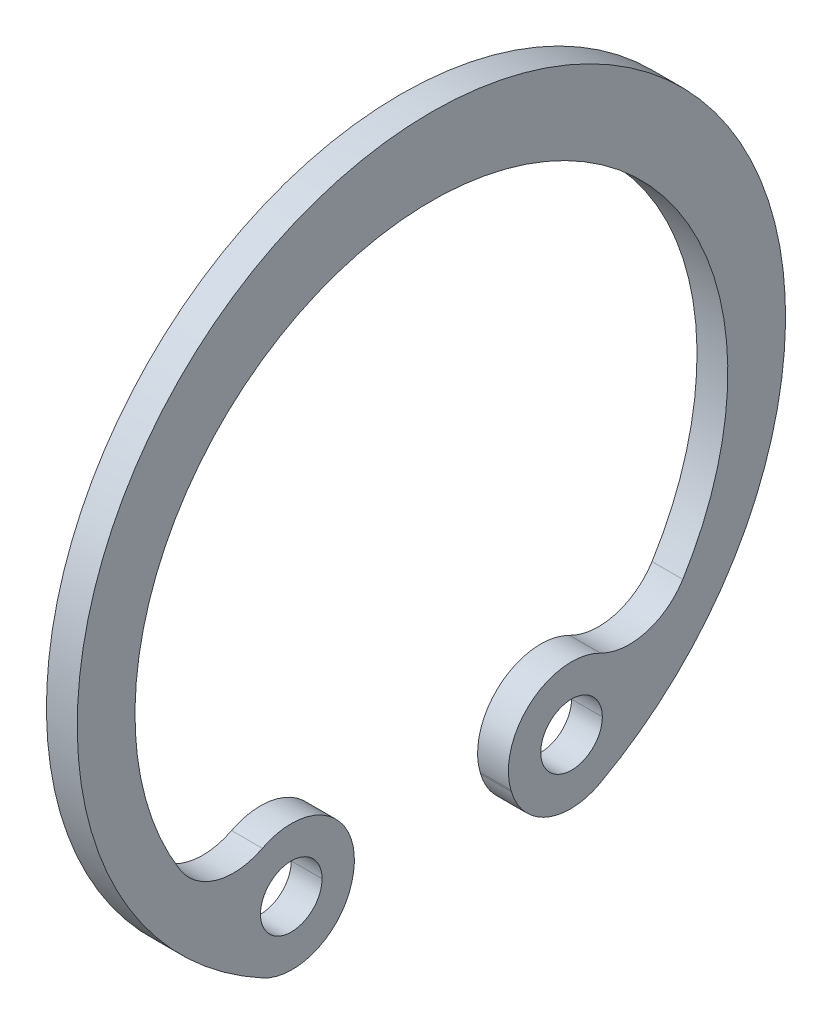
ISO-10303-21;
HEADER;
FILE_DESCRIPTION(('STEP AP214'),'2;1');
FILE_NAME('part.step','',(''),(''),'','','');
FILE_SCHEMA(('AUTOMOTIVE_DESIGN { 1 0 10303 214 1 1 1 1 }'));
ENDSEC;
DATA;
#1=APPLICATION_CONTEXT('core data for automotive mechanical design processes');
#2=APPLICATION_PROTOCOL_DEFINITION('international standard','automotive_design',2000,#1);
#3=PRODUCT_CONTEXT('',#1,'mechanical');
#4=PRODUCT('Part','Part','',(#3));
#5=PRODUCT_RELATED_PRODUCT_CATEGORY('part','',(#4));
#6=PRODUCT_DEFINITION_FORMATION('','',#4);
#7=PRODUCT_DEFINITION_CONTEXT('part definition',#1,'design');
#8=PRODUCT_DEFINITION('design','',#6,#7);
#9=PRODUCT_DEFINITION_SHAPE('','',#8);
#10=(LENGTH_UNIT() NAMED_UNIT(*) SI_UNIT(.MILLI.,.METRE.));
#11=(NAMED_UNIT(*) PLANE_ANGLE_UNIT() SI_UNIT($,.RADIAN.));
#12=(NAMED_UNIT(*) SI_UNIT($,.STERADIAN.) SOLID_ANGLE_UNIT());
#13=UNCERTAINTY_MEASURE_WITH_UNIT(LENGTH_MEASURE(1.E-05),#10,'distance_accuracy_value','');
#14=(GEOMETRIC_REPRESENTATION_CONTEXT(3) GLOBAL_UNCERTAINTY_ASSIGNED_CONTEXT((#13)) GLOBAL_UNIT_ASSIGNED_CONTEXT((#10,
#11,#12)) REPRESENTATION_CONTEXT('',''));
#15=CARTESIAN_POINT('',(0.,0.,0.));
#16=DIRECTION('',(0.,0.,1.));
#17=DIRECTION('',(1.,0.,0.));
#18=AXIS2_PLACEMENT_3D('',#15,#16,#17);
#19=CARTESIAN_POINT('',(0.5,-8.35614485396469,-4.51938526567201));
#20=DIRECTION('',(-1.,0.,0.));
#21=DIRECTION('',(0.,0.922739691980155,-0.385423741931357));
#22=AXIS2_PLACEMENT_3D('',#19,#20,#21);
#23=CYLINDRICAL_SURFACE('',#22,1.99999999999884);
#24=CARTESIAN_POINT('',(-0.5,-8.35614485396469,-4.51938526567201));
#25=DIRECTION('',(1.,0.,0.));
#26=DIRECTION('',(0.,0.,-1.));
#27=AXIS2_PLACEMENT_3D('',#24,#25,#26);
#28=CIRCLE('',#27,1.99999999999884);
#29=CARTESIAN_POINT('',(-0.5,-8.9159152274564,-2.5993183061739));
#30=VERTEX_POINT('',#29);
#31=CARTESIAN_POINT('',(-0.5,-10.115333244271,-5.4708347952882));
#32=VERTEX_POINT('',#31);
#33=EDGE_CURVE('E11',#30,#32,#28,.T.);
#34=ORIENTED_EDGE('',*,*,#33,.T.);
#35=DIRECTION('',(-1.,0.,0.));
#36=VECTOR('',#35,1.);
#37=CARTESIAN_POINT('',(0.5,-10.115333244271,-5.4708347952882));
#38=LINE('',#37,#36);
#39=CARTESIAN_POINT('',(0.5,-10.115333244271,-5.4708347952882));
#40=VERTEX_POINT('',#39);
#41=EDGE_CURVE('E25',#40,#32,#38,.T.);
#42=ORIENTED_EDGE('',*,*,#41,.F.);
#43=CARTESIAN_POINT('',(0.5,-8.35614485396469,-4.51938526567201));
#44=DIRECTION('',(1.,0.,0.));
#45=DIRECTION('',(0.,0.,-1.));
#46=AXIS2_PLACEMENT_3D('',#43,#44,#45);
#47=CIRCLE('',#46,1.99999999999884);
#48=CARTESIAN_POINT('',(0.5,-8.9159152274564,-2.5993183061739));
#49=VERTEX_POINT('',#48);
#50=EDGE_CURVE('E301',#49,#40,#47,.T.);
#51=ORIENTED_EDGE('',*,*,#50,.F.);
#52=DIRECTION('',(-1.,0.,0.));
#53=VECTOR('',#52,1.);
#54=CARTESIAN_POINT('',(0.5,-8.9159152274564,-2.5993183061739));
#55=LINE('',#54,#53);
#56=EDGE_CURVE('E297',#49,#30,#55,.T.);
#57=ORIENTED_EDGE('',*,*,#56,.T.);
#58=EDGE_LOOP('',(#34,#42,#51,#57));
#59=FACE_BOUND('',#58,.T.);
#60=ADVANCED_FACE('F17',(#59),#23,.T.);
#61=CARTESIAN_POINT('',(0.5,-8.8562763291698,-2.5819313665136));
#62=DIRECTION('',(0.,0.279885186746055,-0.9600334797496));
#63=DIRECTION('',(0.,0.9600334797496,0.279885186746055));
#64=AXIS2_PLACEMENT_3D('',#61,#62,#63);
#65=PLANE('',#64);
#66=DIRECTION('',(0.,-0.9600334797496,-0.279885186746055));
#67=VECTOR('',#66,1.);
#68=CARTESIAN_POINT('',(-0.5,-8.8562763291698,-2.5819313665136));
#69=LINE('',#68,#67);
#70=CARTESIAN_POINT('',(-0.5,-8.8562763291698,-2.5819313665136));
#71=VERTEX_POINT('',#70);
#72=EDGE_CURVE('E292',#71,#30,#69,.T.);
#73=ORIENTED_EDGE('',*,*,#72,.T.);
#74=ORIENTED_EDGE('',*,*,#56,.F.);
#75=DIRECTION('',(0.,-0.9600334797496,-0.279885186746055));
#76=VECTOR('',#75,1.);
#77=CARTESIAN_POINT('',(0.5,-8.8562763291698,-2.5819313665136));
#78=LINE('',#77,#76);
#79=CARTESIAN_POINT('',(0.5,-8.8562763291698,-2.5819313665136));
#80=VERTEX_POINT('',#79);
#81=EDGE_CURVE('E287',#80,#49,#78,.T.);
#82=ORIENTED_EDGE('',*,*,#81,.F.);
#83=DIRECTION('',(-1.,0.,0.));
#84=VECTOR('',#83,1.);
#85=CARTESIAN_POINT('',(0.5,-8.8562763291698,-2.5819313665136));
#86=LINE('',#85,#84);
#87=EDGE_CURVE('E283',#80,#71,#86,.T.);
#88=ORIENTED_EDGE('',*,*,#87,.T.);
#89=EDGE_LOOP('',(#73,#74,#82,#88));
#90=FACE_BOUND('',#89,.T.);
#91=ADVANCED_FACE('F318',(#90),#65,.F.);
#92=CARTESIAN_POINT('',(0.5,-8.28251169633942,-4.55));
#93=DIRECTION('',(-1.,0.,0.));
#94=DIRECTION('',(0.,-0.771452706473191,-0.636286666271727));
#95=AXIS2_PLACEMENT_3D('',#92,#93,#94);
#96=CYLINDRICAL_SURFACE('',#95,2.04999999999997);
#97=CARTESIAN_POINT('',(-0.5,-8.28251169633942,-4.55));
#98=DIRECTION('',(1.,0.,0.));
#99=DIRECTION('',(0.,0.,-1.));
#100=AXIS2_PLACEMENT_3D('',#97,#98,#99);
#101=CIRCLE('',#100,2.04999999999997);
#102=CARTESIAN_POINT('',(-0.5,-6.4595744916504,-5.4877632685067));
#103=VERTEX_POINT('',#102);
#104=EDGE_CURVE('E278',#103,#71,#101,.T.);
#105=ORIENTED_EDGE('',*,*,#104,.T.);
#106=ORIENTED_EDGE('',*,*,#87,.F.);
#107=CARTESIAN_POINT('',(0.5,-8.28251169633942,-4.55));
#108=DIRECTION('',(1.,0.,0.));
#109=DIRECTION('',(0.,0.,-1.));
#110=AXIS2_PLACEMENT_3D('',#107,#108,#109);
#111=CIRCLE('',#110,2.04999999999997);
#112=CARTESIAN_POINT('',(0.5,-6.4595744916504,-5.4877632685067));
#113=VERTEX_POINT('',#112);
#114=EDGE_CURVE('E273',#113,#80,#111,.T.);
#115=ORIENTED_EDGE('',*,*,#114,.F.);
#116=DIRECTION('',(-1.,0.,0.));
#117=VECTOR('',#116,1.);
#118=CARTESIAN_POINT('',(0.5,-6.4595744916504,-5.4877632685067));
#119=LINE('',#118,#117);
#120=EDGE_CURVE('E269',#113,#103,#119,.T.);
#121=ORIENTED_EDGE('',*,*,#120,.T.);
#122=EDGE_LOOP('',(#105,#106,#115,#121));
#123=FACE_BOUND('',#122,.T.);
#124=ADVANCED_FACE('F350',(#123),#96,.T.);
#125=CARTESIAN_POINT('',(0.5,-4.63663728696139,-6.42552653701331));
#126=DIRECTION('',(-1.,0.,0.));
#127=DIRECTION('',(0.,0.964095608375025,0.265555376356778));
#128=AXIS2_PLACEMENT_3D('',#125,#126,#127);
#129=CYLINDRICAL_SURFACE('',#128,2.0499999999999);
#130=CARTESIAN_POINT('',(-0.5,-4.63663728696139,-6.42552653701331));
#131=DIRECTION('',(1.,0.,0.));
#132=DIRECTION('',(0.,0.,-1.));
#133=AXIS2_PLACEMENT_3D('',#130,#131,#132);
#134=CIRCLE('',#133,2.0499999999999);
#135=CARTESIAN_POINT('',(-0.5,-5.7222949025745,-8.1644479100664));
#136=VERTEX_POINT('',#135);
#137=EDGE_CURVE('E264',#103,#136,#134,.T.);
#138=ORIENTED_EDGE('',*,*,#137,.F.);
#139=ORIENTED_EDGE('',*,*,#120,.F.);
#140=CARTESIAN_POINT('',(0.5,-4.63663728696139,-6.42552653701331));
#141=DIRECTION('',(1.,0.,0.));
#142=DIRECTION('',(0.,0.,-1.));
#143=AXIS2_PLACEMENT_3D('',#140,#141,#142);
#144=CIRCLE('',#143,2.0499999999999);
#145=CARTESIAN_POINT('',(0.5,-5.7222949025745,-8.1644479100664));
#146=VERTEX_POINT('',#145);
#147=EDGE_CURVE('E260',#113,#146,#144,.T.);
#148=ORIENTED_EDGE('',*,*,#147,.T.);
#149=DIRECTION('',(-1.,0.,0.));
#150=VECTOR('',#149,1.);
#151=CARTESIAN_POINT('',(0.5,-5.7222949025745,-8.1644479100664));
#152=LINE('',#151,#150);
#153=EDGE_CURVE('E256',#146,#136,#152,.T.);
#154=ORIENTED_EDGE('',*,*,#153,.T.);
#155=EDGE_LOOP('',(#138,#139,#148,#154));
#156=FACE_BOUND('',#155,.T.);
#157=ADVANCED_FACE('F347',(#156),#129,.F.);
#158=CARTESIAN_POINT('',(0.5,-0.624999999999986,0.));
#159=DIRECTION('',(-1.,0.,0.));
#160=DIRECTION('',(0.,-1.,0.));
#161=AXIS2_PLACEMENT_3D('',#158,#159,#160);
#162=CYLINDRICAL_SURFACE('',#161,9.625);
#163=CARTESIAN_POINT('',(-0.5,-0.624999999999986,0.));
#164=DIRECTION('',(1.,0.,0.));
#165=DIRECTION('',(0.,0.,-1.));
#166=AXIS2_PLACEMENT_3D('',#163,#164,#165);
#167=CIRCLE('',#166,9.625);
#168=CARTESIAN_POINT('',(-0.5,-5.7222949025745,8.1644479100664));
#169=VERTEX_POINT('',#168);
#170=EDGE_CURVE('E251',#136,#169,#167,.T.);
#171=ORIENTED_EDGE('',*,*,#170,.F.);
#172=ORIENTED_EDGE('',*,*,#153,.F.);
#173=CARTESIAN_POINT('',(0.5,-0.624999999999986,0.));
#174=DIRECTION('',(1.,0.,0.));
#175=DIRECTION('',(0.,0.,-1.));
#176=AXIS2_PLACEMENT_3D('',#173,#174,#175);
#177=CIRCLE('',#176,9.625);
#178=CARTESIAN_POINT('',(0.5,-5.7222949025745,8.1644479100664));
#179=VERTEX_POINT('',#178);
#180=EDGE_CURVE('E247',#146,#179,#177,.T.);
#181=ORIENTED_EDGE('',*,*,#180,.T.);
#182=DIRECTION('',(-1.,0.,0.));
#183=VECTOR('',#182,1.);
#184=CARTESIAN_POINT('',(0.5,-5.7222949025745,8.1644479100664));
#185=LINE('',#184,#183);
#186=EDGE_CURVE('E243',#179,#169,#185,.T.);
#187=ORIENTED_EDGE('',*,*,#186,.T.);
#188=EDGE_LOOP('',(#171,#172,#181,#187));
#189=FACE_BOUND('',#188,.T.);
#190=ADVANCED_FACE('F344',(#189),#162,.F.);
#191=CARTESIAN_POINT('',(0.5,-4.63663728696139,6.42552653701331));
#192=DIRECTION('',(-1.,0.,0.));
#193=DIRECTION('',(0.,0.964095608375026,-0.265555376356777));
#194=AXIS2_PLACEMENT_3D('',#191,#192,#193);
#195=CYLINDRICAL_SURFACE('',#194,2.0499999999999);
#196=CARTESIAN_POINT('',(-0.5,-4.63663728696139,6.42552653701331));
#197=DIRECTION('',(1.,0.,0.));
#198=DIRECTION('',(0.,0.,-1.));
#199=AXIS2_PLACEMENT_3D('',#196,#197,#198);
#200=CIRCLE('',#199,2.0499999999999);
#201=CARTESIAN_POINT('',(-0.5,-6.4595744916504,5.4877632685067));
#202=VERTEX_POINT('',#201);
#203=EDGE_CURVE('E238',#169,#202,#200,.T.);
#204=ORIENTED_EDGE('',*,*,#203,.F.);
#205=ORIENTED_EDGE('',*,*,#186,.F.);
#206=CARTESIAN_POINT('',(0.5,-4.63663728696139,6.42552653701331));
#207=DIRECTION('',(1.,0.,0.));
#208=DIRECTION('',(0.,0.,-1.));
#209=AXIS2_PLACEMENT_3D('',#206,#207,#208);
#210=CIRCLE('',#209,2.0499999999999);
#211=CARTESIAN_POINT('',(0.5,-6.4595744916504,5.4877632685067));
#212=VERTEX_POINT('',#211);
#213=EDGE_CURVE('E234',#179,#212,#210,.T.);
#214=ORIENTED_EDGE('',*,*,#213,.T.);
#215=DIRECTION('',(-1.,0.,0.));
#216=VECTOR('',#215,1.);
#217=CARTESIAN_POINT('',(0.5,-6.4595744916504,5.4877632685067));
#218=LINE('',#217,#216);
#219=EDGE_CURVE('E230',#212,#202,#218,.T.);
#220=ORIENTED_EDGE('',*,*,#219,.T.);
#221=EDGE_LOOP('',(#204,#205,#214,#220));
#222=FACE_BOUND('',#221,.T.);
#223=ADVANCED_FACE('F337',(#222),#195,.F.);
#224=CARTESIAN_POINT('',(0.5,-8.28251169633942,4.55));
#225=DIRECTION('',(-1.,0.,0.));
#226=DIRECTION('',(0.,-0.771452706473191,0.636286666271728));
#227=AXIS2_PLACEMENT_3D('',#224,#225,#226);
#228=CYLINDRICAL_SURFACE('',#227,2.04999999999997);
#229=CARTESIAN_POINT('',(-0.5,-8.28251169633942,4.55));
#230=DIRECTION('',(1.,0.,0.));
#231=DIRECTION('',(0.,0.,-1.));
#232=AXIS2_PLACEMENT_3D('',#229,#230,#231);
#233=CIRCLE('',#232,2.04999999999997);
#234=CARTESIAN_POINT('',(-0.5,-8.8562763291698,2.5819313665136));
#235=VERTEX_POINT('',#234);
#236=EDGE_CURVE('E225',#235,#202,#233,.T.);
#237=ORIENTED_EDGE('',*,*,#236,.T.);
#238=ORIENTED_EDGE('',*,*,#219,.F.);
#239=CARTESIAN_POINT('',(0.5,-8.28251169633942,4.55));
#240=DIRECTION('',(1.,0.,0.));
#241=DIRECTION('',(0.,0.,-1.));
#242=AXIS2_PLACEMENT_3D('',#239,#240,#241);
#243=CIRCLE('',#242,2.04999999999997);
#244=CARTESIAN_POINT('',(0.5,-8.8562763291698,2.5819313665136));
#245=VERTEX_POINT('',#244);
#246=EDGE_CURVE('E220',#245,#212,#243,.T.);
#247=ORIENTED_EDGE('',*,*,#246,.F.);
#248=DIRECTION('',(-1.,0.,0.));
#249=VECTOR('',#248,1.);
#250=CARTESIAN_POINT('',(0.5,-8.8562763291698,2.5819313665136));
#251=LINE('',#250,#249);
#252=EDGE_CURVE('E216',#245,#235,#251,.T.);
#253=ORIENTED_EDGE('',*,*,#252,.T.);
#254=EDGE_LOOP('',(#237,#238,#247,#253));
#255=FACE_BOUND('',#254,.T.);
#256=ADVANCED_FACE('F334',(#255),#228,.T.);
#257=CARTESIAN_POINT('',(0.5,-8.9159152274564,2.5993183061739));
#258=DIRECTION('',(0.,0.279885186746055,0.9600334797496));
#259=DIRECTION('',(0.,-0.9600334797496,0.279885186746055));
#260=AXIS2_PLACEMENT_3D('',#257,#258,#259);
#261=PLANE('',#260);
#262=DIRECTION('',(0.,0.9600334797496,-0.279885186746055));
#263=VECTOR('',#262,1.);
#264=CARTESIAN_POINT('',(-0.5,-8.9159152274564,2.5993183061739));
#265=LINE('',#264,#263);
#266=CARTESIAN_POINT('',(-0.5,-8.9159152274564,2.5993183061739));
#267=VERTEX_POINT('',#266);
#268=EDGE_CURVE('E211',#267,#235,#265,.T.);
#269=ORIENTED_EDGE('',*,*,#268,.T.);
#270=ORIENTED_EDGE('',*,*,#252,.F.);
#271=DIRECTION('',(0.,0.9600334797496,-0.279885186746055));
#272=VECTOR('',#271,1.);
#273=CARTESIAN_POINT('',(0.5,-8.9159152274564,2.5993183061739));
#274=LINE('',#273,#272);
#275=CARTESIAN_POINT('',(0.5,-8.9159152274564,2.5993183061739));
#276=VERTEX_POINT('',#275);
#277=EDGE_CURVE('E206',#276,#245,#274,.T.);
#278=ORIENTED_EDGE('',*,*,#277,.F.);
#279=DIRECTION('',(-1.,0.,0.));
#280=VECTOR('',#279,1.);
#281=CARTESIAN_POINT('',(0.5,-8.9159152274564,2.5993183061739));
#282=LINE('',#281,#280);
#283=EDGE_CURVE('E202',#276,#267,#282,.T.);
#284=ORIENTED_EDGE('',*,*,#283,.T.);
#285=EDGE_LOOP('',(#269,#270,#278,#284));
#286=FACE_BOUND('',#285,.T.);
#287=ADVANCED_FACE('F332',(#286),#261,.F.);
#288=CARTESIAN_POINT('',(0.5,-8.3561448539647,4.51938526567201));
#289=DIRECTION('',(-1.,0.,0.));
#290=DIRECTION('',(0.,0.922739691980155,0.385423741931357));
#291=AXIS2_PLACEMENT_3D('',#288,#289,#290);
#292=CYLINDRICAL_SURFACE('',#291,1.99999999999884);
#293=CARTESIAN_POINT('',(-0.5,-8.3561448539647,4.51938526567201));
#294=DIRECTION('',(1.,0.,0.));
#295=DIRECTION('',(0.,0.,-1.));
#296=AXIS2_PLACEMENT_3D('',#293,#294,#295);
#297=CIRCLE('',#296,1.99999999999884);
#298=CARTESIAN_POINT('',(-0.5,-10.115333244271,5.47083479528821));
#299=VERTEX_POINT('',#298);
#300=EDGE_CURVE('E197',#299,#267,#297,.T.);
#301=ORIENTED_EDGE('',*,*,#300,.T.);
#302=ORIENTED_EDGE('',*,*,#283,.F.);
#303=CARTESIAN_POINT('',(0.5,-8.3561448539647,4.51938526567201));
#304=DIRECTION('',(1.,0.,0.));
#305=DIRECTION('',(0.,0.,-1.));
#306=AXIS2_PLACEMENT_3D('',#303,#304,#305);
#307=CIRCLE('',#306,1.99999999999884);
#308=CARTESIAN_POINT('',(0.5,-10.115333244271,5.47083479528821));
#309=VERTEX_POINT('',#308);
#310=EDGE_CURVE('E192',#309,#276,#307,.T.);
#311=ORIENTED_EDGE('',*,*,#310,.F.);
#312=DIRECTION('',(-1.,0.,0.));
#313=VECTOR('',#312,1.);
#314=CARTESIAN_POINT('',(0.5,-10.115333244271,5.47083479528821));
#315=LINE('',#314,#313);
#316=EDGE_CURVE('E188',#309,#299,#315,.T.);
#317=ORIENTED_EDGE('',*,*,#316,.T.);
#318=EDGE_LOOP('',(#301,#302,#311,#317));
#319=FACE_BOUND('',#318,.T.);
#320=ADVANCED_FACE('F327',(#319),#292,.T.);
#321=CARTESIAN_POINT('',(0.5,2.27682456221956E-13,0.));
#322=DIRECTION('',(-1.,0.,0.));
#323=DIRECTION('',(0.,-1.,0.));
#324=AXIS2_PLACEMENT_3D('',#321,#322,#323);
#325=CYLINDRICAL_SURFACE('',#324,11.4999999999998);
#326=CARTESIAN_POINT('',(-0.5,2.27682456221956E-13,0.));
#327=DIRECTION('',(1.,0.,0.));
#328=DIRECTION('',(0.,0.,-1.));
#329=AXIS2_PLACEMENT_3D('',#326,#327,#328);
#330=CIRCLE('',#329,11.4999999999998);
#331=EDGE_CURVE('E183',#32,#299,#330,.T.);
#332=ORIENTED_EDGE('',*,*,#331,.T.);
#333=ORIENTED_EDGE('',*,*,#316,.F.);
#334=CARTESIAN_POINT('',(0.5,2.27682456221956E-13,0.));
#335=DIRECTION('',(1.,0.,0.));
#336=DIRECTION('',(0.,0.,-1.));
#337=AXIS2_PLACEMENT_3D('',#334,#335,#336);
#338=CIRCLE('',#337,11.4999999999998);
#339=EDGE_CURVE('E178',#40,#309,#338,.T.);
#340=ORIENTED_EDGE('',*,*,#339,.F.);
#341=ORIENTED_EDGE('',*,*,#41,.T.);
#342=EDGE_LOOP('',(#332,#333,#340,#341));
#343=FACE_BOUND('',#342,.T.);
#344=ADVANCED_FACE('F311',(#343),#325,.T.);
#345=CARTESIAN_POINT('',(0.5,-8.35614485396469,-4.51938526567201));
#346=DIRECTION('',(1.,0.,0.));
#347=DIRECTION('',(0.,0.,-1.));
#348=AXIS2_PLACEMENT_3D('',#345,#346,#347);
#349=PLANE('',#348);
#350=CARTESIAN_POINT('',(0.5,-8.2825116963395,4.55));
#351=DIRECTION('',(1.,0.,0.));
#352=DIRECTION('',(0.,0.,-1.));
#353=AXIS2_PLACEMENT_3D('',#350,#351,#352);
#354=CIRCLE('',#353,1.);
#355=CARTESIAN_POINT('',(0.5,-8.2825116963395,5.55));
#356=VERTEX_POINT('',#355);
#357=CARTESIAN_POINT('',(0.5,-8.2825116963395,3.55));
#358=VERTEX_POINT('',#357);
#359=EDGE_CURVE('E134',#356,#358,#354,.T.);
#360=ORIENTED_EDGE('',*,*,#359,.F.);
#361=CARTESIAN_POINT('',(0.5,-8.2825116963395,4.55));
#362=DIRECTION('',(1.,0.,0.));
#363=DIRECTION('',(0.,0.,-1.));
#364=AXIS2_PLACEMENT_3D('',#361,#362,#363);
#365=CIRCLE('',#364,1.);
#366=EDGE_CURVE('E171',#358,#356,#365,.T.);
#367=ORIENTED_EDGE('',*,*,#366,.F.);
#368=EDGE_LOOP('',(#360,#367));
#369=FACE_BOUND('',#368,.T.);
#370=CARTESIAN_POINT('',(0.5,-8.2825116963395,-4.55));
#371=DIRECTION('',(1.,0.,0.));
#372=DIRECTION('',(0.,0.,-1.));
#373=AXIS2_PLACEMENT_3D('',#370,#371,#372);
#374=CIRCLE('',#373,1.);
#375=CARTESIAN_POINT('',(0.5,-8.2825116963395,-3.55));
#376=VERTEX_POINT('',#375);
#377=CARTESIAN_POINT('',(0.5,-8.2825116963395,-5.55));
#378=VERTEX_POINT('',#377);
#379=EDGE_CURVE('E166',#376,#378,#374,.T.);
#380=ORIENTED_EDGE('',*,*,#379,.F.);
#381=CARTESIAN_POINT('',(0.5,-8.2825116963395,-4.55));
#382=DIRECTION('',(1.,0.,0.));
#383=DIRECTION('',(0.,0.,-1.));
#384=AXIS2_PLACEMENT_3D('',#381,#382,#383);
#385=CIRCLE('',#384,1.);
#386=EDGE_CURVE('E161',#378,#376,#385,.T.);
#387=ORIENTED_EDGE('',*,*,#386,.F.);
#388=EDGE_LOOP('',(#380,#387));
#389=FACE_BOUND('',#388,.T.);
#390=ORIENTED_EDGE('',*,*,#50,.T.);
#391=ORIENTED_EDGE('',*,*,#339,.T.);
#392=ORIENTED_EDGE('',*,*,#310,.T.);
#393=ORIENTED_EDGE('',*,*,#277,.T.);
#394=ORIENTED_EDGE('',*,*,#246,.T.);
#395=ORIENTED_EDGE('',*,*,#213,.F.);
#396=ORIENTED_EDGE('',*,*,#180,.F.);
#397=ORIENTED_EDGE('',*,*,#147,.F.);
#398=ORIENTED_EDGE('',*,*,#114,.T.);
#399=ORIENTED_EDGE('',*,*,#81,.T.);
#400=EDGE_LOOP('',(#390,#391,#392,#393,#394,#395,#396,#397,#398,#399));
#401=FACE_BOUND('',#400,.T.);
#402=ADVANCED_FACE('F315',(#369,#389,#401),#349,.T.);
#403=CARTESIAN_POINT('',(0.5,-8.2825116963395,-4.55));
#404=DIRECTION('',(-1.,0.,0.));
#405=DIRECTION('',(0.,-1.,0.));
#406=AXIS2_PLACEMENT_3D('',#403,#404,#405);
#407=CYLINDRICAL_SURFACE('',#406,1.);
#408=DIRECTION('',(-1.,0.,0.));
#409=VECTOR('',#408,1.);
#410=CARTESIAN_POINT('',(0.5,-8.2825116963395,-5.55));
#411=LINE('',#410,#409);
#412=CARTESIAN_POINT('',(-0.5,-8.2825116963395,-5.55));
#413=VERTEX_POINT('',#412);
#414=EDGE_CURVE('E156',#378,#413,#411,.T.);
#415=ORIENTED_EDGE('',*,*,#414,.F.);
#416=ORIENTED_EDGE('',*,*,#386,.T.);
#417=DIRECTION('',(-1.,0.,0.));
#418=VECTOR('',#417,1.);
#419=CARTESIAN_POINT('',(0.5,-8.2825116963395,-3.55));
#420=LINE('',#419,#418);
#421=CARTESIAN_POINT('',(-0.5,-8.2825116963395,-3.55));
#422=VERTEX_POINT('',#421);
#423=EDGE_CURVE('E152',#376,#422,#420,.T.);
#424=ORIENTED_EDGE('',*,*,#423,.T.);
#425=CARTESIAN_POINT('',(-0.5,-8.2825116963395,-4.55));
#426=DIRECTION('',(1.,0.,0.));
#427=DIRECTION('',(0.,0.,-1.));
#428=AXIS2_PLACEMENT_3D('',#425,#426,#427);
#429=CIRCLE('',#428,1.);
#430=EDGE_CURVE('E131',#413,#422,#429,.T.);
#431=ORIENTED_EDGE('',*,*,#430,.F.);
#432=EDGE_LOOP('',(#415,#416,#424,#431));
#433=FACE_BOUND('',#432,.T.);
#434=ADVANCED_FACE('F447',(#433),#407,.F.);
#435=CARTESIAN_POINT('',(-0.5,-8.35614485396469,-4.51938526567201));
#436=DIRECTION('',(1.,0.,0.));
#437=DIRECTION('',(0.,0.,-1.));
#438=AXIS2_PLACEMENT_3D('',#435,#436,#437);
#439=PLANE('',#438);
#440=CARTESIAN_POINT('',(-0.5,-8.2825116963395,4.55));
#441=DIRECTION('',(1.,0.,0.));
#442=DIRECTION('',(0.,0.,-1.));
#443=AXIS2_PLACEMENT_3D('',#440,#441,#442);
#444=CIRCLE('',#443,1.);
#445=CARTESIAN_POINT('',(-0.5,-8.2825116963395,3.55));
#446=VERTEX_POINT('',#445);
#447=CARTESIAN_POINT('',(-0.5,-8.2825116963395,5.55));
#448=VERTEX_POINT('',#447);
#449=EDGE_CURVE('E117',#446,#448,#444,.T.);
#450=ORIENTED_EDGE('',*,*,#449,.T.);
#451=CARTESIAN_POINT('',(-0.5,-8.2825116963395,4.55));
#452=DIRECTION('',(1.,0.,0.));
#453=DIRECTION('',(0.,0.,-1.));
#454=AXIS2_PLACEMENT_3D('',#451,#452,#453);
#455=CIRCLE('',#454,1.);
#456=EDGE_CURVE('E113',#448,#446,#455,.T.);
#457=ORIENTED_EDGE('',*,*,#456,.T.);
#458=EDGE_LOOP('',(#450,#457));
#459=FACE_BOUND('',#458,.T.);
#460=ORIENTED_EDGE('',*,*,#430,.T.);
#461=CARTESIAN_POINT('',(-0.5,-8.2825116963395,-4.55));
#462=DIRECTION('',(1.,0.,0.));
#463=DIRECTION('',(0.,0.,-1.));
#464=AXIS2_PLACEMENT_3D('',#461,#462,#463);
#465=CIRCLE('',#464,1.);
#466=EDGE_CURVE('E122',#422,#413,#465,.T.);
#467=ORIENTED_EDGE('',*,*,#466,.T.);
#468=EDGE_LOOP('',(#460,#467));
#469=FACE_BOUND('',#468,.T.);
#470=ORIENTED_EDGE('',*,*,#33,.F.);
#471=ORIENTED_EDGE('',*,*,#72,.F.);
#472=ORIENTED_EDGE('',*,*,#104,.F.);
#473=ORIENTED_EDGE('',*,*,#137,.T.);
#474=ORIENTED_EDGE('',*,*,#170,.T.);
#475=ORIENTED_EDGE('',*,*,#203,.T.);
#476=ORIENTED_EDGE('',*,*,#236,.F.);
#477=ORIENTED_EDGE('',*,*,#268,.F.);
#478=ORIENTED_EDGE('',*,*,#300,.F.);
#479=ORIENTED_EDGE('',*,*,#331,.F.);
#480=EDGE_LOOP('',(#470,#471,#472,#473,#474,#475,#476,#477,#478,#479));
#481=FACE_BOUND('',#480,.T.);
#482=ADVANCED_FACE('F115',(#459,#469,#481),#439,.F.);
#483=CARTESIAN_POINT('',(0.5,-8.2825116963395,-4.55));
#484=DIRECTION('',(-1.,0.,0.));
#485=DIRECTION('',(0.,1.,0.));
#486=AXIS2_PLACEMENT_3D('',#483,#484,#485);
#487=CYLINDRICAL_SURFACE('',#486,1.);
#488=ORIENTED_EDGE('',*,*,#414,.T.);
#489=ORIENTED_EDGE('',*,*,#466,.F.);
#490=ORIENTED_EDGE('',*,*,#423,.F.);
#491=ORIENTED_EDGE('',*,*,#379,.T.);
#492=EDGE_LOOP('',(#488,#489,#490,#491));
#493=FACE_BOUND('',#492,.T.);
#494=ADVANCED_FACE('F468',(#493),#487,.F.);
#495=CARTESIAN_POINT('',(0.5,-8.2825116963395,4.55));
#496=DIRECTION('',(-1.,0.,0.));
#497=DIRECTION('',(0.,1.,0.));
#498=AXIS2_PLACEMENT_3D('',#495,#496,#497);
#499=CYLINDRICAL_SURFACE('',#498,1.);
#500=DIRECTION('',(-1.,0.,0.));
#501=VECTOR('',#500,1.);
#502=CARTESIAN_POINT('',(0.5,-8.2825116963395,3.55));
#503=LINE('',#502,#501);
#504=EDGE_CURVE('E128',#358,#446,#503,.T.);
#505=ORIENTED_EDGE('',*,*,#504,.T.);
#506=ORIENTED_EDGE('',*,*,#456,.F.);
#507=DIRECTION('',(-1.,0.,0.));
#508=VECTOR('',#507,1.);
#509=CARTESIAN_POINT('',(0.5,-8.2825116963395,5.55));
#510=LINE('',#509,#508);
#511=EDGE_CURVE('E130',#356,#448,#510,.T.);
#512=ORIENTED_EDGE('',*,*,#511,.F.);
#513=ORIENTED_EDGE('',*,*,#359,.T.);
#514=EDGE_LOOP('',(#505,#506,#512,#513));
#515=FACE_BOUND('',#514,.T.);
#516=ADVANCED_FACE('F133',(#515),#499,.F.);
#517=CARTESIAN_POINT('',(0.5,-8.2825116963395,4.55));
#518=DIRECTION('',(-1.,0.,0.));
#519=DIRECTION('',(0.,-1.,0.));
#520=AXIS2_PLACEMENT_3D('',#517,#518,#519);
#521=CYLINDRICAL_SURFACE('',#520,1.);
#522=ORIENTED_EDGE('',*,*,#504,.F.);
#523=ORIENTED_EDGE('',*,*,#366,.T.);
#524=ORIENTED_EDGE('',*,*,#511,.T.);
#525=ORIENTED_EDGE('',*,*,#449,.F.);
#526=EDGE_LOOP('',(#522,#523,#524,#525));
#527=FACE_BOUND('',#526,.T.);
#528=ADVANCED_FACE('F126',(#527),#521,.F.);
#529=CLOSED_SHELL('',(#60,#91,#124,#157,#190,#223,#256,#287,#320,#344,#402,#434,#482,#494,#516,#528));
#530=MANIFOLD_SOLID_BREP('B1',#529);
#531=ADVANCED_BREP_SHAPE_REPRESENTATION('',(#18,#530),#14);
#532=SHAPE_DEFINITION_REPRESENTATION(#9,#531);
ENDSEC;
END-ISO-10303-21;
